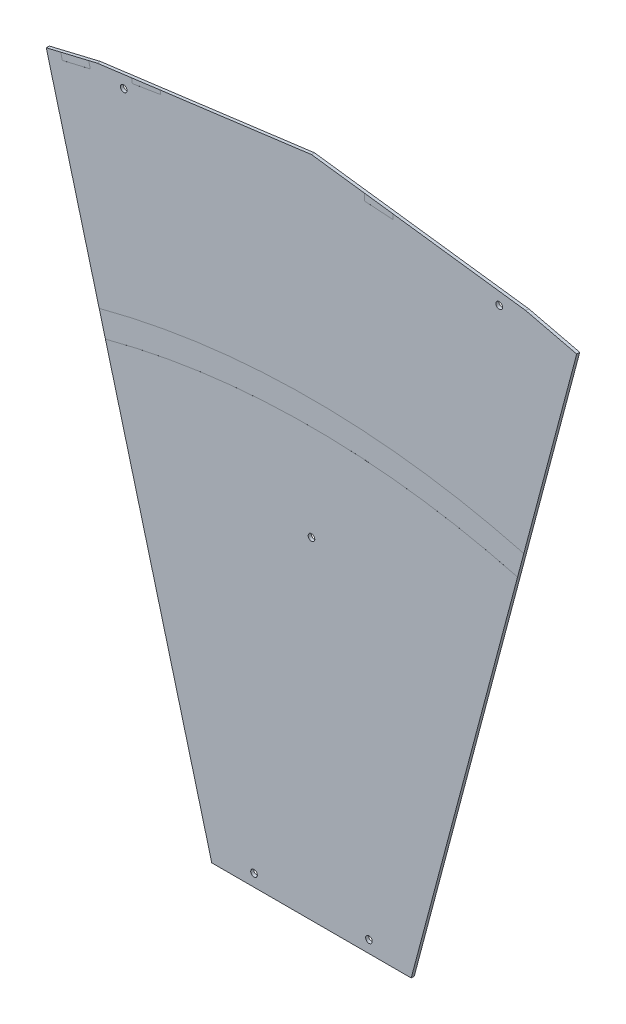
ISO-10303-21;
HEADER;
FILE_DESCRIPTION(('STEP AP214'),'2;1');
FILE_NAME('part.step','',(''),(''),'','','');
FILE_SCHEMA(('AUTOMOTIVE_DESIGN { 1 0 10303 214 1 1 1 1 }'));
ENDSEC;
DATA;
#1=APPLICATION_CONTEXT('core data for automotive mechanical design processes');
#2=APPLICATION_PROTOCOL_DEFINITION('international standard','automotive_design',2000,#1);
#3=PRODUCT_CONTEXT('',#1,'mechanical');
#4=PRODUCT('Part','Part','',(#3));
#5=PRODUCT_RELATED_PRODUCT_CATEGORY('part','',(#4));
#6=PRODUCT_DEFINITION_FORMATION('','',#4);
#7=PRODUCT_DEFINITION_CONTEXT('part definition',#1,'design');
#8=PRODUCT_DEFINITION('design','',#6,#7);
#9=PRODUCT_DEFINITION_SHAPE('','',#8);
#10=(LENGTH_UNIT() NAMED_UNIT(*) SI_UNIT(.MILLI.,.METRE.));
#11=(NAMED_UNIT(*) PLANE_ANGLE_UNIT() SI_UNIT($,.RADIAN.));
#12=(NAMED_UNIT(*) SI_UNIT($,.STERADIAN.) SOLID_ANGLE_UNIT());
#13=UNCERTAINTY_MEASURE_WITH_UNIT(LENGTH_MEASURE(1.E-05),#10,'distance_accuracy_value','');
#14=(GEOMETRIC_REPRESENTATION_CONTEXT(3) GLOBAL_UNCERTAINTY_ASSIGNED_CONTEXT((#13)) GLOBAL_UNIT_ASSIGNED_CONTEXT((#10,
#11,#12)) REPRESENTATION_CONTEXT('',''));
#15=CARTESIAN_POINT('',(0.,0.,0.));
#16=DIRECTION('',(0.,0.,1.));
#17=DIRECTION('',(1.,0.,0.));
#18=AXIS2_PLACEMENT_3D('',#15,#16,#17);
#19=CARTESIAN_POINT('',(-52.0600023755688,196.,1.58749999999985));
#20=DIRECTION('',(0.,0.,-1.));
#21=DIRECTION('',(0.,1.,0.));
#22=AXIS2_PLACEMENT_3D('',#19,#20,#21);
#23=PLANE('',#22);
#24=CARTESIAN_POINT('',(-30.,202.35,1.58749999999989));
#25=DIRECTION('',(0.,0.,1.));
#26=DIRECTION('',(1.,0.,0.));
#27=AXIS2_PLACEMENT_3D('',#24,#25,#26);
#28=CIRCLE('',#27,1.7272);
#29=CARTESIAN_POINT('',(-28.2728,202.35,1.58749999999989));
#30=VERTEX_POINT('',#29);
#31=EDGE_CURVE('E304',#30,#30,#28,.T.);
#32=ORIENTED_EDGE('',*,*,#31,.F.);
#33=EDGE_LOOP('',(#32));
#34=FACE_BOUND('',#33,.T.);
#35=CARTESIAN_POINT('',(0.,369.15,1.58749999999989));
#36=DIRECTION('',(0.,0.,1.));
#37=DIRECTION('',(1.,0.,0.));
#38=AXIS2_PLACEMENT_3D('',#35,#36,#37);
#39=CIRCLE('',#38,1.72720000000004);
#40=CARTESIAN_POINT('',(1.72720000000004,369.15,1.58749999999989));
#41=VERTEX_POINT('',#40);
#42=EDGE_CURVE('E298',#41,#41,#39,.T.);
#43=ORIENTED_EDGE('',*,*,#42,.F.);
#44=EDGE_LOOP('',(#43));
#45=FACE_BOUND('',#44,.T.);
#46=CARTESIAN_POINT('',(30.,202.35,1.58749999999989));
#47=DIRECTION('',(0.,0.,1.));
#48=DIRECTION('',(-1.,0.,0.));
#49=AXIS2_PLACEMENT_3D('',#46,#47,#48);
#50=CIRCLE('',#49,1.7272);
#51=CARTESIAN_POINT('',(28.2728,202.35,1.58749999999989));
#52=VERTEX_POINT('',#51);
#53=EDGE_CURVE('E292',#52,#52,#50,.T.);
#54=ORIENTED_EDGE('',*,*,#53,.F.);
#55=EDGE_LOOP('',(#54));
#56=FACE_BOUND('',#55,.T.);
#57=DIRECTION('',(-0.256711107580929,-0.966488182671973,0.));
#58=VECTOR('',#57,1.);
#59=CARTESIAN_POINT('',(139.214433641138,524.126541463011,1.58749999999978));
#60=LINE('',#59,#58);
#61=CARTESIAN_POINT('',(107.587625187167,405.055197357824,1.58749999999989));
#62=VERTEX_POINT('',#61);
#63=CARTESIAN_POINT('',(52.0600023755688,196.,1.58749999999985));
#64=VERTEX_POINT('',#63);
#65=EDGE_CURVE('E357',#62,#64,#60,.T.);
#66=ORIENTED_EDGE('',*,*,#65,.F.);
#67=CARTESIAN_POINT('',(0.,0.,1.58749999999989));
#68=DIRECTION('',(0.,0.,-1.));
#69=DIRECTION('',(-1.,0.,0.));
#70=AXIS2_PLACEMENT_3D('',#67,#68,#69);
#71=CIRCLE('',#70,419.1);
#72=CARTESIAN_POINT('',(-107.587625187167,405.055197357824,1.58749999999989));
#73=VERTEX_POINT('',#72);
#74=EDGE_CURVE('E257',#73,#62,#71,.T.);
#75=ORIENTED_EDGE('',*,*,#74,.F.);
#76=DIRECTION('',(-0.256711107580929,0.966488182671973,0.));
#77=VECTOR('',#76,1.);
#78=CARTESIAN_POINT('',(-52.0600023755688,196.,1.58749999999985));
#79=LINE('',#78,#77);
#80=CARTESIAN_POINT('',(-52.0600023755688,196.,1.58749999999985));
#81=VERTEX_POINT('',#80);
#82=EDGE_CURVE('E348',#81,#73,#79,.T.);
#83=ORIENTED_EDGE('',*,*,#82,.F.);
#84=DIRECTION('',(-1.,0.,0.));
#85=VECTOR('',#84,1.);
#86=CARTESIAN_POINT('',(52.0600023755688,196.,1.58749999999985));
#87=LINE('',#86,#85);
#88=EDGE_CURVE('E343',#64,#81,#87,.T.);
#89=ORIENTED_EDGE('',*,*,#88,.F.);
#90=EDGE_LOOP('',(#66,#75,#83,#89));
#91=FACE_BOUND('',#90,.T.);
#92=ADVANCED_FACE('F30',(#34,#45,#56,#91),#23,.F.);
#93=CARTESIAN_POINT('',(52.0600023755688,196.,1.58749999999985));
#94=DIRECTION('',(0.,-1.,0.));
#95=DIRECTION('',(0.,0.,-1.));
#96=AXIS2_PLACEMENT_3D('',#93,#94,#95);
#97=PLANE('',#96);
#98=DIRECTION('',(-1.,0.,0.));
#99=VECTOR('',#98,1.);
#100=CARTESIAN_POINT('',(52.0600023755688,196.,0.));
#101=LINE('',#100,#99);
#102=CARTESIAN_POINT('',(52.0600023755688,196.,0.));
#103=VERTEX_POINT('',#102);
#104=CARTESIAN_POINT('',(-52.0600023755688,196.,0.));
#105=VERTEX_POINT('',#104);
#106=EDGE_CURVE('E340',#103,#105,#101,.T.);
#107=ORIENTED_EDGE('',*,*,#106,.F.);
#108=DIRECTION('',(0.,0.,-1.));
#109=VECTOR('',#108,1.);
#110=CARTESIAN_POINT('',(52.0600023755688,196.,1.58749999999985));
#111=LINE('',#110,#109);
#112=EDGE_CURVE('E373',#64,#103,#111,.T.);
#113=ORIENTED_EDGE('',*,*,#112,.F.);
#114=ORIENTED_EDGE('',*,*,#88,.T.);
#115=DIRECTION('',(0.,0.,-1.));
#116=VECTOR('',#115,1.);
#117=CARTESIAN_POINT('',(-52.0600023755688,196.,1.58749999999985));
#118=LINE('',#117,#116);
#119=EDGE_CURVE('E361',#81,#105,#118,.T.);
#120=ORIENTED_EDGE('',*,*,#119,.T.);
#121=EDGE_LOOP('',(#107,#113,#114,#120));
#122=FACE_BOUND('',#121,.T.);
#123=ADVANCED_FACE('F32',(#122),#97,.T.);
#124=CARTESIAN_POINT('',(139.214433641138,524.126541463011,1.58749999999978));
#125=DIRECTION('',(0.966488182671973,-0.256711107580929,0.));
#126=DIRECTION('',(0.256711107580929,0.966488182671973,0.));
#127=AXIS2_PLACEMENT_3D('',#124,#125,#126);
#128=PLANE('',#127);
#129=DIRECTION('',(0.,0.,1.));
#130=VECTOR('',#129,1.);
#131=CARTESIAN_POINT('',(107.587625187167,405.055197357824,1.58249999999989));
#132=LINE('',#131,#130);
#133=CARTESIAN_POINT('',(107.587625187167,405.055197357824,1.58249999999989));
#134=VERTEX_POINT('',#133);
#135=EDGE_CURVE('E276',#134,#62,#132,.T.);
#136=ORIENTED_EDGE('',*,*,#135,.T.);
#137=ORIENTED_EDGE('',*,*,#65,.T.);
#138=ORIENTED_EDGE('',*,*,#112,.T.);
#139=DIRECTION('',(-0.256711107580929,-0.966488182671973,0.));
#140=VECTOR('',#139,1.);
#141=CARTESIAN_POINT('',(139.214433641138,524.126541463011,-1.15413476644949E-13));
#142=LINE('',#141,#140);
#143=CARTESIAN_POINT('',(138.475953663492,521.346248166548,-1.14801251752575E-13));
#144=VERTEX_POINT('',#143);
#145=EDGE_CURVE('E347',#144,#103,#142,.T.);
#146=ORIENTED_EDGE('',*,*,#145,.F.);
#147=DIRECTION('',(0.,0.,1.));
#148=VECTOR('',#147,1.);
#149=CARTESIAN_POINT('',(138.475953663492,521.346248166548,-1.20346441145891E-13));
#150=LINE('',#149,#148);
#151=CARTESIAN_POINT('',(138.475953663492,521.346248166548,1.58749999999989));
#152=VERTEX_POINT('',#151);
#153=EDGE_CURVE('E324',#144,#152,#150,.T.);
#154=ORIENTED_EDGE('',*,*,#153,.T.);
#155=CARTESIAN_POINT('',(110.847856253445,417.329597277758,1.5874999999998));
#156=VERTEX_POINT('',#155);
#157=EDGE_CURVE('E358',#152,#156,#60,.T.);
#158=ORIENTED_EDGE('',*,*,#157,.T.);
#159=DIRECTION('',(0.,0.,1.));
#160=VECTOR('',#159,1.);
#161=CARTESIAN_POINT('',(110.847856253445,417.329597277758,1.58249999999989));
#162=LINE('',#161,#160);
#163=CARTESIAN_POINT('',(110.847856253445,417.329597277758,1.58249999999989));
#164=VERTEX_POINT('',#163);
#165=EDGE_CURVE('E285',#164,#156,#162,.T.);
#166=ORIENTED_EDGE('',*,*,#165,.F.);
#167=DIRECTION('',(0.256711107580928,0.966488182671973,0.));
#168=VECTOR('',#167,1.);
#169=CARTESIAN_POINT('',(110.847856253445,417.329597277758,1.58249999999989));
#170=LINE('',#169,#168);
#171=EDGE_CURVE('E266',#134,#164,#170,.T.);
#172=ORIENTED_EDGE('',*,*,#171,.F.);
#173=EDGE_LOOP('',(#136,#137,#138,#146,#154,#158,#166,#172));
#174=FACE_BOUND('',#173,.T.);
#175=ADVANCED_FACE('F428',(#174),#128,.T.);
#176=CARTESIAN_POINT('',(0.,542.3,1.58749999999977));
#177=DIRECTION('',(0.129444616203277,0.99158665346806,0.));
#178=DIRECTION('',(-0.99158665346806,0.129444616203277,0.));
#179=AXIS2_PLACEMENT_3D('',#176,#177,#178);
#180=PLANE('',#179);
#181=DIRECTION('',(0.,0.,1.));
#182=VECTOR('',#181,1.);
#183=CARTESIAN_POINT('',(42.6950039305214,536.726469559413,1.58249999999989));
#184=LINE('',#183,#182);
#185=CARTESIAN_POINT('',(42.6950039305214,536.726469559413,1.58249999999989));
#186=VERTEX_POINT('',#185);
#187=CARTESIAN_POINT('',(42.6950039305214,536.726469559413,1.58749999999989));
#188=VERTEX_POINT('',#187);
#189=EDGE_CURVE('E225',#186,#188,#184,.T.);
#190=ORIENTED_EDGE('',*,*,#189,.T.);
#191=DIRECTION('',(0.99158665346806,-0.129444616203277,0.));
#192=VECTOR('',#191,1.);
#193=CARTESIAN_POINT('',(0.,542.3,1.58749999999977));
#194=LINE('',#193,#192);
#195=CARTESIAN_POINT('',(111.862580020806,527.697132275169,1.58749999999989));
#196=VERTEX_POINT('',#195);
#197=EDGE_CURVE('E355',#188,#196,#194,.T.);
#198=ORIENTED_EDGE('',*,*,#197,.T.);
#199=DIRECTION('',(0.,0.,1.));
#200=VECTOR('',#199,1.);
#201=CARTESIAN_POINT('',(111.862580020806,527.697132275169,-1.20346441145891E-13));
#202=LINE('',#201,#200);
#203=CARTESIAN_POINT('',(111.862580020806,527.697132275169,-1.20346441145891E-13));
#204=VERTEX_POINT('',#203);
#205=EDGE_CURVE('E322',#204,#196,#202,.T.);
#206=ORIENTED_EDGE('',*,*,#205,.F.);
#207=DIRECTION('',(0.99158665346806,-0.129444616203277,0.));
#208=VECTOR('',#207,1.);
#209=CARTESIAN_POINT('',(0.,542.3,-1.20414789250844E-13));
#210=LINE('',#209,#208);
#211=CARTESIAN_POINT('',(0.,542.3,-1.20414789250844E-13));
#212=VERTEX_POINT('',#211);
#213=EDGE_CURVE('E369',#212,#204,#210,.T.);
#214=ORIENTED_EDGE('',*,*,#213,.F.);
#215=DIRECTION('',(0.,0.,-1.));
#216=VECTOR('',#215,1.);
#217=CARTESIAN_POINT('',(0.,542.3,1.58749999999977));
#218=LINE('',#217,#216);
#219=CARTESIAN_POINT('',(0.,542.3,1.58749999999977));
#220=VERTEX_POINT('',#219);
#221=EDGE_CURVE('E377',#220,#212,#218,.T.);
#222=ORIENTED_EDGE('',*,*,#221,.F.);
#223=CARTESIAN_POINT('',(27.790346618401,538.672167031905,1.58749999999977));
#224=VERTEX_POINT('',#223);
#225=EDGE_CURVE('E208',#220,#224,#194,.T.);
#226=ORIENTED_EDGE('',*,*,#225,.T.);
#227=DIRECTION('',(0.,0.,1.));
#228=VECTOR('',#227,1.);
#229=CARTESIAN_POINT('',(27.790346618401,538.672167031905,1.58249999999989));
#230=LINE('',#229,#228);
#231=CARTESIAN_POINT('',(27.790346618401,538.672167031905,1.58249999999989));
#232=VERTEX_POINT('',#231);
#233=EDGE_CURVE('E45',#232,#224,#230,.T.);
#234=ORIENTED_EDGE('',*,*,#233,.F.);
#235=DIRECTION('',(-0.99158665346806,0.129444616203278,0.));
#236=VECTOR('',#235,1.);
#237=CARTESIAN_POINT('',(42.6950039305214,536.726469559413,1.58249999999989));
#238=LINE('',#237,#236);
#239=EDGE_CURVE('E193',#186,#232,#238,.T.);
#240=ORIENTED_EDGE('',*,*,#239,.F.);
#241=EDGE_LOOP('',(#190,#198,#206,#214,#222,#226,#234,#240));
#242=FACE_BOUND('',#241,.T.);
#243=ADVANCED_FACE('F205',(#242),#180,.T.);
#244=CARTESIAN_POINT('',(-139.214433641138,524.126541463011,1.58749999999978));
#245=DIRECTION('',(-0.129444616203277,0.99158665346806,0.));
#246=DIRECTION('',(-0.99158665346806,-0.129444616203277,0.));
#247=AXIS2_PLACEMENT_3D('',#244,#245,#246);
#248=PLANE('',#247);
#249=DIRECTION('',(0.,0.,1.));
#250=VECTOR('',#249,1.);
#251=CARTESIAN_POINT('',(-79.0399411374419,531.981895364886,1.58249999999989));
#252=LINE('',#251,#250);
#253=CARTESIAN_POINT('',(-79.0399411374419,531.981895364886,1.58249999999989));
#254=VERTEX_POINT('',#253);
#255=CARTESIAN_POINT('',(-79.0399411374419,531.981895364886,1.58749999999989));
#256=VERTEX_POINT('',#255);
#257=EDGE_CURVE('E254',#254,#256,#252,.T.);
#258=ORIENTED_EDGE('',*,*,#257,.T.);
#259=DIRECTION('',(0.99158665346806,0.129444616203277,0.));
#260=VECTOR('',#259,1.);
#261=CARTESIAN_POINT('',(-139.214433641138,524.126541463011,1.58749999999978));
#262=LINE('',#261,#260);
#263=EDGE_CURVE('E351',#256,#220,#262,.T.);
#264=ORIENTED_EDGE('',*,*,#263,.T.);
#265=ORIENTED_EDGE('',*,*,#221,.T.);
#266=DIRECTION('',(0.99158665346806,0.129444616203277,0.));
#267=VECTOR('',#266,1.);
#268=CARTESIAN_POINT('',(-139.214433641138,524.126541463011,-1.17345465014806E-13));
#269=LINE('',#268,#267);
#270=CARTESIAN_POINT('',(-111.862580020806,527.697132275169,-1.17948503830694E-13));
#271=VERTEX_POINT('',#270);
#272=EDGE_CURVE('E367',#271,#212,#269,.T.);
#273=ORIENTED_EDGE('',*,*,#272,.F.);
#274=DIRECTION('',(0.,0.,1.));
#275=VECTOR('',#274,1.);
#276=CARTESIAN_POINT('',(-111.862580020806,527.697132275169,-1.20346441145891E-13));
#277=LINE('',#276,#275);
#278=CARTESIAN_POINT('',(-111.862580020806,527.697132275169,1.58749999999989));
#279=VERTEX_POINT('',#278);
#280=EDGE_CURVE('E337',#271,#279,#277,.T.);
#281=ORIENTED_EDGE('',*,*,#280,.T.);
#282=CARTESIAN_POINT('',(-93.9211862672078,530.03925418702,1.58749999999978));
#283=VERTEX_POINT('',#282);
#284=EDGE_CURVE('E352',#279,#283,#262,.T.);
#285=ORIENTED_EDGE('',*,*,#284,.T.);
#286=DIRECTION('',(0.,0.,1.));
#287=VECTOR('',#286,1.);
#288=CARTESIAN_POINT('',(-93.9211862672078,530.03925418702,1.58249999999989));
#289=LINE('',#288,#287);
#290=CARTESIAN_POINT('',(-93.9211862672078,530.03925418702,1.58249999999989));
#291=VERTEX_POINT('',#290);
#292=EDGE_CURVE('E247',#291,#283,#289,.T.);
#293=ORIENTED_EDGE('',*,*,#292,.F.);
#294=DIRECTION('',(-0.99158665346806,-0.129444616203276,0.));
#295=VECTOR('',#294,1.);
#296=CARTESIAN_POINT('',(-79.0399411374419,531.981895364886,1.58249999999989));
#297=LINE('',#296,#295);
#298=EDGE_CURVE('E234',#254,#291,#297,.T.);
#299=ORIENTED_EDGE('',*,*,#298,.F.);
#300=EDGE_LOOP('',(#258,#264,#265,#273,#281,#285,#293,#299));
#301=FACE_BOUND('',#300,.T.);
#302=ADVANCED_FACE('F409',(#301),#248,.T.);
#303=CARTESIAN_POINT('',(-52.0600023755688,196.,1.58749999999985));
#304=DIRECTION('',(-0.966488182671973,-0.256711107580929,0.));
#305=DIRECTION('',(0.256711107580929,-0.966488182671973,0.));
#306=AXIS2_PLACEMENT_3D('',#303,#304,#305);
#307=PLANE('',#306);
#308=DIRECTION('',(0.,0.,1.));
#309=VECTOR('',#308,1.);
#310=CARTESIAN_POINT('',(-107.587625187167,405.055197357824,1.58249999999989));
#311=LINE('',#310,#309);
#312=CARTESIAN_POINT('',(-107.587625187167,405.055197357824,1.58249999999989));
#313=VERTEX_POINT('',#312);
#314=EDGE_CURVE('E279',#313,#73,#311,.T.);
#315=ORIENTED_EDGE('',*,*,#314,.F.);
#316=DIRECTION('',(0.256711107580929,-0.966488182671973,0.));
#317=VECTOR('',#316,1.);
#318=CARTESIAN_POINT('',(-107.587625187167,405.055197357824,1.58249999999989));
#319=LINE('',#318,#317);
#320=CARTESIAN_POINT('',(-110.847856253445,417.329597277758,1.58249999999989));
#321=VERTEX_POINT('',#320);
#322=EDGE_CURVE('E273',#321,#313,#319,.T.);
#323=ORIENTED_EDGE('',*,*,#322,.F.);
#324=DIRECTION('',(0.,0.,1.));
#325=VECTOR('',#324,1.);
#326=CARTESIAN_POINT('',(-110.847856253445,417.329597277758,1.58249999999989));
#327=LINE('',#326,#325);
#328=CARTESIAN_POINT('',(-110.847856253445,417.329597277758,1.58749999999989));
#329=VERTEX_POINT('',#328);
#330=EDGE_CURVE('E282',#321,#329,#327,.T.);
#331=ORIENTED_EDGE('',*,*,#330,.T.);
#332=CARTESIAN_POINT('',(-138.475953663492,521.346248166548,1.58749999999989));
#333=VERTEX_POINT('',#332);
#334=EDGE_CURVE('E346',#329,#333,#79,.T.);
#335=ORIENTED_EDGE('',*,*,#334,.T.);
#336=DIRECTION('',(0.,0.,1.));
#337=VECTOR('',#336,1.);
#338=CARTESIAN_POINT('',(-138.475953663492,521.346248166548,-1.20346441145891E-13));
#339=LINE('',#338,#337);
#340=CARTESIAN_POINT('',(-138.475953663492,521.346248166548,-1.20346441145891E-13));
#341=VERTEX_POINT('',#340);
#342=EDGE_CURVE('E333',#341,#333,#339,.T.);
#343=ORIENTED_EDGE('',*,*,#342,.F.);
#344=DIRECTION('',(-0.256711107580929,0.966488182671973,0.));
#345=VECTOR('',#344,1.);
#346=CARTESIAN_POINT('',(-52.0600023755688,196.,0.));
#347=LINE('',#346,#345);
#348=EDGE_CURVE('E364',#105,#341,#347,.T.);
#349=ORIENTED_EDGE('',*,*,#348,.F.);
#350=ORIENTED_EDGE('',*,*,#119,.F.);
#351=ORIENTED_EDGE('',*,*,#82,.T.);
#352=EDGE_LOOP('',(#315,#323,#331,#335,#343,#349,#350,#351));
#353=FACE_BOUND('',#352,.T.);
#354=ADVANCED_FACE('F419',(#353),#307,.T.);
#355=CARTESIAN_POINT('',(98.0409242651112,523.097573518041,1.58749999999989));
#356=DIRECTION('',(0.,0.,1.));
#357=DIRECTION('',(-1.,0.,0.));
#358=AXIS2_PLACEMENT_3D('',#355,#356,#357);
#359=CIRCLE('',#358,1.72720000000006);
#360=CARTESIAN_POINT('',(96.3137242651112,523.097573518041,1.58749999999989));
#361=VERTEX_POINT('',#360);
#362=EDGE_CURVE('E281',#361,#361,#359,.T.);
#363=ORIENTED_EDGE('',*,*,#362,.F.);
#364=EDGE_LOOP('',(#363));
#365=FACE_BOUND('',#364,.T.);
#366=CARTESIAN_POINT('',(-98.0409242651112,523.097573518041,1.58749999999989));
#367=DIRECTION('',(0.,0.,1.));
#368=DIRECTION('',(1.,0.,0.));
#369=AXIS2_PLACEMENT_3D('',#366,#367,#368);
#370=CIRCLE('',#369,1.72720000000006);
#371=CARTESIAN_POINT('',(-96.3137242651112,523.097573518041,1.58749999999989));
#372=VERTEX_POINT('',#371);
#373=EDGE_CURVE('E310',#372,#372,#370,.T.);
#374=ORIENTED_EDGE('',*,*,#373,.F.);
#375=EDGE_LOOP('',(#374));
#376=FACE_BOUND('',#375,.T.);
#377=ORIENTED_EDGE('',*,*,#197,.F.);
#378=DIRECTION('',(0.0654031292300864,0.997858923238607,0.));
#379=VECTOR('',#378,1.);
#380=CARTESIAN_POINT('',(42.5269385657457,534.162287602022,1.58749999999989));
#381=LINE('',#380,#379);
#382=CARTESIAN_POINT('',(42.5269385657457,534.162287602022,1.58749999999989));
#383=VERTEX_POINT('',#382);
#384=EDGE_CURVE('E202',#383,#188,#381,.T.);
#385=ORIENTED_EDGE('',*,*,#384,.F.);
#386=DIRECTION('',(0.997858923238607,-0.0654031292300916,0.));
#387=VECTOR('',#386,1.);
#388=CARTESIAN_POINT('',(27.5590547172177,535.14333454047,1.58749999999989));
#389=LINE('',#388,#387);
#390=CARTESIAN_POINT('',(27.5590547172177,535.14333454047,1.58749999999989));
#391=VERTEX_POINT('',#390);
#392=EDGE_CURVE('E438',#391,#383,#389,.T.);
#393=ORIENTED_EDGE('',*,*,#392,.F.);
#394=DIRECTION('',(-0.0654031292300884,-0.997858923238607,0.));
#395=VECTOR('',#394,1.);
#396=CARTESIAN_POINT('',(27.790346618401,538.672167031905,1.58749999999989));
#397=LINE('',#396,#395);
#398=EDGE_CURVE('E441',#224,#391,#397,.T.);
#399=ORIENTED_EDGE('',*,*,#398,.F.);
#400=ORIENTED_EDGE('',*,*,#225,.F.);
#401=ORIENTED_EDGE('',*,*,#263,.F.);
#402=DIRECTION('',(-0.160742565603862,0.986996366560226,0.));
#403=VECTOR('',#402,1.);
#404=CARTESIAN_POINT('',(-78.7233939013794,530.038222444993,1.58749999999989));
#405=LINE('',#404,#403);
#406=CARTESIAN_POINT('',(-78.7233939013794,530.038222444993,1.58749999999989));
#407=VERTEX_POINT('',#406);
#408=EDGE_CURVE('E238',#407,#256,#405,.T.);
#409=ORIENTED_EDGE('',*,*,#408,.F.);
#410=DIRECTION('',(0.986996366560225,0.160742565603871,0.));
#411=VECTOR('',#410,1.);
#412=CARTESIAN_POINT('',(-93.5283393997322,527.627083960943,1.58749999999989));
#413=LINE('',#412,#411);
#414=CARTESIAN_POINT('',(-93.5283393997322,527.627083960943,1.58749999999989));
#415=VERTEX_POINT('',#414);
#416=EDGE_CURVE('E250',#415,#407,#413,.T.);
#417=ORIENTED_EDGE('',*,*,#416,.F.);
#418=DIRECTION('',(0.160742565603883,-0.986996366560223,0.));
#419=VECTOR('',#418,1.);
#420=CARTESIAN_POINT('',(-93.9211862672078,530.03925418702,1.58749999999989));
#421=LINE('',#420,#419);
#422=EDGE_CURVE('E231',#283,#415,#421,.T.);
#423=ORIENTED_EDGE('',*,*,#422,.F.);
#424=ORIENTED_EDGE('',*,*,#284,.F.);
#425=DIRECTION('',(0.972687775406542,0.232117409029725,0.));
#426=VECTOR('',#425,1.);
#427=CARTESIAN_POINT('',(-138.475953663492,521.346248166548,1.58749999999989));
#428=LINE('',#427,#426);
#429=CARTESIAN_POINT('',(-116.301629699761,526.637819373244,1.58749999999989));
#430=VERTEX_POINT('',#429);
#431=EDGE_CURVE('E327',#430,#279,#428,.T.);
#432=ORIENTED_EDGE('',*,*,#431,.F.);
#433=DIRECTION('',(-0.229200390922413,0.973379258460449,0.));
#434=VECTOR('',#433,1.);
#435=CARTESIAN_POINT('',(-115.505225017795,523.255609615022,1.58749999999989));
#436=LINE('',#435,#434);
#437=CARTESIAN_POINT('',(-115.505225017795,523.255609615022,1.58749999999989));
#438=VERTEX_POINT('',#437);
#439=EDGE_CURVE('E218',#438,#430,#436,.T.);
#440=ORIENTED_EDGE('',*,*,#439,.F.);
#441=DIRECTION('',(0.97337925846045,0.229200390922405,0.));
#442=VECTOR('',#441,1.);
#443=CARTESIAN_POINT('',(-130.105913894652,519.817603751197,1.58749999999989));
#444=LINE('',#443,#442);
#445=CARTESIAN_POINT('',(-130.105913894652,519.817603751197,1.58749999999989));
#446=VERTEX_POINT('',#445);
#447=EDGE_CURVE('E224',#446,#438,#444,.T.);
#448=ORIENTED_EDGE('',*,*,#447,.F.);
#449=DIRECTION('',(0.229200390922405,-0.973379258460451,0.));
#450=VECTOR('',#449,1.);
#451=CARTESIAN_POINT('',(-131.361910987031,525.151632691935,1.58749999999989));
#452=LINE('',#451,#450);
#453=CARTESIAN_POINT('',(-130.892011893738,523.156042592196,1.58749999999989));
#454=VERTEX_POINT('',#453);
#455=EDGE_CURVE('E222',#454,#446,#452,.T.);
#456=ORIENTED_EDGE('',*,*,#455,.F.);
#457=EDGE_CURVE('E334',#333,#454,#428,.T.);
#458=ORIENTED_EDGE('',*,*,#457,.F.);
#459=ORIENTED_EDGE('',*,*,#334,.F.);
#460=CARTESIAN_POINT('',(0.,0.,1.58749999999989));
#461=DIRECTION('',(0.,0.,1.));
#462=DIRECTION('',(1.,0.,0.));
#463=AXIS2_PLACEMENT_3D('',#460,#461,#462);
#464=CIRCLE('',#463,431.8);
#465=EDGE_CURVE('E267',#156,#329,#464,.T.);
#466=ORIENTED_EDGE('',*,*,#465,.F.);
#467=ORIENTED_EDGE('',*,*,#157,.F.);
#468=DIRECTION('',(0.972687775406542,-0.232117409029725,0.));
#469=VECTOR('',#468,1.);
#470=CARTESIAN_POINT('',(138.475953663492,521.346248166548,1.58749999999989));
#471=LINE('',#470,#469);
#472=EDGE_CURVE('E316',#196,#152,#471,.T.);
#473=ORIENTED_EDGE('',*,*,#472,.F.);
#474=EDGE_LOOP('',(#377,#385,#393,#399,#400,#401,#409,#417,#423,#424,#432,#440,#448,#456,#458,
#459,#466,#467,#473));
#475=FACE_BOUND('',#474,.T.);
#476=ADVANCED_FACE('F394',(#365,#376,#475),#23,.F.);
#477=CARTESIAN_POINT('',(-52.0600023755688,196.,0.));
#478=DIRECTION('',(0.,0.,-1.));
#479=DIRECTION('',(0.,1.,0.));
#480=AXIS2_PLACEMENT_3D('',#477,#478,#479);
#481=PLANE('',#480);
#482=CARTESIAN_POINT('',(98.0409242651112,523.097573518041,-1.20346441145891E-13));
#483=DIRECTION('',(0.,0.,1.));
#484=DIRECTION('',(-1.,0.,0.));
#485=AXIS2_PLACEMENT_3D('',#482,#483,#484);
#486=CIRCLE('',#485,1.72720000000006);
#487=CARTESIAN_POINT('',(96.3137242651112,523.097573518041,-1.20346441145891E-13));
#488=VERTEX_POINT('',#487);
#489=EDGE_CURVE('E289',#488,#488,#486,.T.);
#490=ORIENTED_EDGE('',*,*,#489,.T.);
#491=EDGE_LOOP('',(#490));
#492=FACE_BOUND('',#491,.T.);
#493=CARTESIAN_POINT('',(30.,202.35,-1.20346441145891E-13));
#494=DIRECTION('',(0.,0.,1.));
#495=DIRECTION('',(-1.,0.,0.));
#496=AXIS2_PLACEMENT_3D('',#493,#494,#495);
#497=CIRCLE('',#496,1.7272);
#498=CARTESIAN_POINT('',(28.2728,202.35,-1.20346441145891E-13));
#499=VERTEX_POINT('',#498);
#500=EDGE_CURVE('E295',#499,#499,#497,.T.);
#501=ORIENTED_EDGE('',*,*,#500,.T.);
#502=EDGE_LOOP('',(#501));
#503=FACE_BOUND('',#502,.T.);
#504=CARTESIAN_POINT('',(0.,369.15,-1.20346441145891E-13));
#505=DIRECTION('',(0.,0.,1.));
#506=DIRECTION('',(1.,0.,0.));
#507=AXIS2_PLACEMENT_3D('',#504,#505,#506);
#508=CIRCLE('',#507,1.72720000000004);
#509=CARTESIAN_POINT('',(1.72720000000004,369.15,-1.20346441145891E-13));
#510=VERTEX_POINT('',#509);
#511=EDGE_CURVE('E301',#510,#510,#508,.T.);
#512=ORIENTED_EDGE('',*,*,#511,.T.);
#513=EDGE_LOOP('',(#512));
#514=FACE_BOUND('',#513,.T.);
#515=CARTESIAN_POINT('',(-30.,202.35,-1.20346441145891E-13));
#516=DIRECTION('',(0.,0.,1.));
#517=DIRECTION('',(1.,0.,0.));
#518=AXIS2_PLACEMENT_3D('',#515,#516,#517);
#519=CIRCLE('',#518,1.7272);
#520=CARTESIAN_POINT('',(-28.2728,202.35,-1.20346441145891E-13));
#521=VERTEX_POINT('',#520);
#522=EDGE_CURVE('E307',#521,#521,#519,.T.);
#523=ORIENTED_EDGE('',*,*,#522,.T.);
#524=EDGE_LOOP('',(#523));
#525=FACE_BOUND('',#524,.T.);
#526=CARTESIAN_POINT('',(-98.0409242651112,523.097573518041,-1.20346441145891E-13));
#527=DIRECTION('',(0.,0.,1.));
#528=DIRECTION('',(1.,0.,0.));
#529=AXIS2_PLACEMENT_3D('',#526,#527,#528);
#530=CIRCLE('',#529,1.72720000000006);
#531=CARTESIAN_POINT('',(-96.3137242651112,523.097573518041,-1.20346441145891E-13));
#532=VERTEX_POINT('',#531);
#533=EDGE_CURVE('E313',#532,#532,#530,.T.);
#534=ORIENTED_EDGE('',*,*,#533,.T.);
#535=EDGE_LOOP('',(#534));
#536=FACE_BOUND('',#535,.T.);
#537=DIRECTION('',(0.972687775406542,-0.232117409029725,0.));
#538=VECTOR('',#537,1.);
#539=CARTESIAN_POINT('',(138.475953663492,521.346248166548,-1.20346441145891E-13));
#540=LINE('',#539,#538);
#541=EDGE_CURVE('E319',#204,#144,#540,.T.);
#542=ORIENTED_EDGE('',*,*,#541,.T.);
#543=ORIENTED_EDGE('',*,*,#145,.T.);
#544=ORIENTED_EDGE('',*,*,#106,.T.);
#545=ORIENTED_EDGE('',*,*,#348,.T.);
#546=DIRECTION('',(0.972687775406542,0.232117409029725,0.));
#547=VECTOR('',#546,1.);
#548=CARTESIAN_POINT('',(-138.475953663492,521.346248166548,-1.20346441145891E-13));
#549=LINE('',#548,#547);
#550=EDGE_CURVE('E330',#341,#271,#549,.T.);
#551=ORIENTED_EDGE('',*,*,#550,.T.);
#552=ORIENTED_EDGE('',*,*,#272,.T.);
#553=ORIENTED_EDGE('',*,*,#213,.T.);
#554=EDGE_LOOP('',(#542,#543,#544,#545,#551,#552,#553));
#555=FACE_BOUND('',#554,.T.);
#556=ADVANCED_FACE('F414',(#492,#503,#514,#525,#536,#555),#481,.T.);
#557=CARTESIAN_POINT('',(-138.475953663492,521.346248166548,-1.20346441145891E-13));
#558=DIRECTION('',(0.232117409029725,-0.972687775406542,0.));
#559=DIRECTION('',(0.972687775406542,0.232117409029725,0.));
#560=AXIS2_PLACEMENT_3D('',#557,#558,#559);
#561=PLANE('',#560);
#562=DIRECTION('',(-0.972687775406542,-0.232117409029725,0.));
#563=VECTOR('',#562,1.);
#564=CARTESIAN_POINT('',(-138.475953663492,521.346248166548,1.58249999999989));
#565=LINE('',#564,#563);
#566=CARTESIAN_POINT('',(-116.301629699761,526.637819373244,1.58249999999989));
#567=VERTEX_POINT('',#566);
#568=CARTESIAN_POINT('',(-130.892011893738,523.156042592196,1.58249999999989));
#569=VERTEX_POINT('',#568);
#570=EDGE_CURVE('E376',#567,#569,#565,.T.);
#571=ORIENTED_EDGE('',*,*,#570,.F.);
#572=DIRECTION('',(0.,0.,1.));
#573=VECTOR('',#572,1.);
#574=CARTESIAN_POINT('',(-116.301629699761,526.637819373244,-1.20346441145891E-13));
#575=LINE('',#574,#573);
#576=EDGE_CURVE('E11',#567,#430,#575,.T.);
#577=ORIENTED_EDGE('',*,*,#576,.T.);
#578=ORIENTED_EDGE('',*,*,#431,.T.);
#579=ORIENTED_EDGE('',*,*,#280,.F.);
#580=ORIENTED_EDGE('',*,*,#550,.F.);
#581=ORIENTED_EDGE('',*,*,#342,.T.);
#582=ORIENTED_EDGE('',*,*,#457,.T.);
#583=DIRECTION('',(0.,0.,-1.));
#584=VECTOR('',#583,1.);
#585=CARTESIAN_POINT('',(-130.892011893738,523.156042592196,-1.20346441145891E-13));
#586=LINE('',#585,#584);
#587=EDGE_CURVE('E38',#454,#569,#586,.T.);
#588=ORIENTED_EDGE('',*,*,#587,.T.);
#589=EDGE_LOOP('',(#571,#577,#578,#579,#580,#581,#582,#588));
#590=FACE_BOUND('',#589,.T.);
#591=ADVANCED_FACE('F384',(#590),#561,.F.);
#592=CARTESIAN_POINT('',(138.475953663492,521.346248166548,-1.20346441145891E-13));
#593=DIRECTION('',(-0.232117409029725,-0.972687775406542,0.));
#594=DIRECTION('',(0.972687775406542,-0.232117409029725,0.));
#595=AXIS2_PLACEMENT_3D('',#592,#593,#594);
#596=PLANE('',#595);
#597=ORIENTED_EDGE('',*,*,#472,.T.);
#598=ORIENTED_EDGE('',*,*,#153,.F.);
#599=ORIENTED_EDGE('',*,*,#541,.F.);
#600=ORIENTED_EDGE('',*,*,#205,.T.);
#601=EDGE_LOOP('',(#597,#598,#599,#600));
#602=FACE_BOUND('',#601,.T.);
#603=ADVANCED_FACE('F432',(#602),#596,.F.);
#604=CARTESIAN_POINT('',(-98.0409242651112,523.097573518041,-1.20346441145891E-13));
#605=DIRECTION('',(0.,0.,1.));
#606=DIRECTION('',(1.,0.,0.));
#607=AXIS2_PLACEMENT_3D('',#604,#605,#606);
#608=CYLINDRICAL_SURFACE('',#607,1.72720000000006);
#609=ORIENTED_EDGE('',*,*,#533,.F.);
#610=EDGE_LOOP('',(#609));
#611=FACE_BOUND('',#610,.T.);
#612=ORIENTED_EDGE('',*,*,#373,.T.);
#613=EDGE_LOOP('',(#612));
#614=FACE_BOUND('',#613,.T.);
#615=ADVANCED_FACE('F492',(#611,#614),#608,.F.);
#616=CARTESIAN_POINT('',(-30.,202.35,-1.20346441145891E-13));
#617=DIRECTION('',(0.,0.,1.));
#618=DIRECTION('',(1.,0.,0.));
#619=AXIS2_PLACEMENT_3D('',#616,#617,#618);
#620=CYLINDRICAL_SURFACE('',#619,1.7272);
#621=ORIENTED_EDGE('',*,*,#522,.F.);
#622=EDGE_LOOP('',(#621));
#623=FACE_BOUND('',#622,.T.);
#624=ORIENTED_EDGE('',*,*,#31,.T.);
#625=EDGE_LOOP('',(#624));
#626=FACE_BOUND('',#625,.T.);
#627=ADVANCED_FACE('F494',(#623,#626),#620,.F.);
#628=CARTESIAN_POINT('',(0.,369.15,-1.20346441145891E-13));
#629=DIRECTION('',(0.,0.,1.));
#630=DIRECTION('',(1.,0.,0.));
#631=AXIS2_PLACEMENT_3D('',#628,#629,#630);
#632=CYLINDRICAL_SURFACE('',#631,1.72720000000004);
#633=ORIENTED_EDGE('',*,*,#511,.F.);
#634=EDGE_LOOP('',(#633));
#635=FACE_BOUND('',#634,.T.);
#636=ORIENTED_EDGE('',*,*,#42,.T.);
#637=EDGE_LOOP('',(#636));
#638=FACE_BOUND('',#637,.T.);
#639=ADVANCED_FACE('F501',(#635,#638),#632,.F.);
#640=CARTESIAN_POINT('',(30.,202.35,-1.20346441145891E-13));
#641=DIRECTION('',(0.,0.,1.));
#642=DIRECTION('',(1.,0.,0.));
#643=AXIS2_PLACEMENT_3D('',#640,#641,#642);
#644=CYLINDRICAL_SURFACE('',#643,1.7272);
#645=ORIENTED_EDGE('',*,*,#500,.F.);
#646=EDGE_LOOP('',(#645));
#647=FACE_BOUND('',#646,.T.);
#648=ORIENTED_EDGE('',*,*,#53,.T.);
#649=EDGE_LOOP('',(#648));
#650=FACE_BOUND('',#649,.T.);
#651=ADVANCED_FACE('F544',(#647,#650),#644,.F.);
#652=CARTESIAN_POINT('',(98.0409242651112,523.097573518041,-1.20346441145891E-13));
#653=DIRECTION('',(0.,0.,1.));
#654=DIRECTION('',(1.,0.,0.));
#655=AXIS2_PLACEMENT_3D('',#652,#653,#654);
#656=CYLINDRICAL_SURFACE('',#655,1.72720000000006);
#657=ORIENTED_EDGE('',*,*,#489,.F.);
#658=EDGE_LOOP('',(#657));
#659=FACE_BOUND('',#658,.T.);
#660=ORIENTED_EDGE('',*,*,#362,.T.);
#661=EDGE_LOOP('',(#660));
#662=FACE_BOUND('',#661,.T.);
#663=ADVANCED_FACE('F553',(#659,#662),#656,.F.);
#664=CARTESIAN_POINT('',(0.,0.,1.58249999999989));
#665=DIRECTION('',(0.,0.,1.));
#666=DIRECTION('',(1.,0.,0.));
#667=AXIS2_PLACEMENT_3D('',#664,#665,#666);
#668=CYLINDRICAL_SURFACE('',#667,419.1);
#669=ORIENTED_EDGE('',*,*,#74,.T.);
#670=ORIENTED_EDGE('',*,*,#135,.F.);
#671=CARTESIAN_POINT('',(0.,0.,1.58249999999989));
#672=DIRECTION('',(0.,0.,-1.));
#673=DIRECTION('',(-1.,0.,0.));
#674=AXIS2_PLACEMENT_3D('',#671,#672,#673);
#675=CIRCLE('',#674,419.1);
#676=EDGE_CURVE('E263',#313,#134,#675,.T.);
#677=ORIENTED_EDGE('',*,*,#676,.F.);
#678=ORIENTED_EDGE('',*,*,#314,.T.);
#679=EDGE_LOOP('',(#669,#670,#677,#678));
#680=FACE_BOUND('',#679,.T.);
#681=ADVANCED_FACE('F562',(#680),#668,.T.);
#682=CARTESIAN_POINT('',(0.,0.,1.58249999999989));
#683=DIRECTION('',(0.,0.,1.));
#684=DIRECTION('',(1.,0.,0.));
#685=AXIS2_PLACEMENT_3D('',#682,#683,#684);
#686=CYLINDRICAL_SURFACE('',#685,431.8);
#687=ORIENTED_EDGE('',*,*,#465,.T.);
#688=ORIENTED_EDGE('',*,*,#330,.F.);
#689=CARTESIAN_POINT('',(0.,0.,1.58249999999989));
#690=DIRECTION('',(0.,0.,1.));
#691=DIRECTION('',(1.,0.,0.));
#692=AXIS2_PLACEMENT_3D('',#689,#690,#691);
#693=CIRCLE('',#692,431.8);
#694=EDGE_CURVE('E270',#164,#321,#693,.T.);
#695=ORIENTED_EDGE('',*,*,#694,.F.);
#696=ORIENTED_EDGE('',*,*,#165,.T.);
#697=EDGE_LOOP('',(#687,#688,#695,#696));
#698=FACE_BOUND('',#697,.T.);
#699=ADVANCED_FACE('F613',(#698),#686,.F.);
#700=CARTESIAN_POINT('',(0.,0.,1.58249999999989));
#701=DIRECTION('',(0.,0.,-1.));
#702=DIRECTION('',(-1.,0.,0.));
#703=AXIS2_PLACEMENT_3D('',#700,#701,#702);
#704=PLANE('',#703);
#705=ORIENTED_EDGE('',*,*,#676,.T.);
#706=ORIENTED_EDGE('',*,*,#171,.T.);
#707=ORIENTED_EDGE('',*,*,#694,.T.);
#708=ORIENTED_EDGE('',*,*,#322,.T.);
#709=EDGE_LOOP('',(#705,#706,#707,#708));
#710=FACE_BOUND('',#709,.T.);
#711=ADVANCED_FACE('F622',(#710),#704,.F.);
#712=CARTESIAN_POINT('',(-78.7233939013794,530.038222444993,1.58249999999989));
#713=DIRECTION('',(0.986996366560226,0.160742565603862,0.));
#714=DIRECTION('',(-0.160742565603862,0.986996366560226,0.));
#715=AXIS2_PLACEMENT_3D('',#712,#713,#714);
#716=PLANE('',#715);
#717=ORIENTED_EDGE('',*,*,#408,.T.);
#718=ORIENTED_EDGE('',*,*,#257,.F.);
#719=DIRECTION('',(-0.160742565603862,0.986996366560226,0.));
#720=VECTOR('',#719,1.);
#721=CARTESIAN_POINT('',(-78.7233939013794,530.038222444993,1.58249999999989));
#722=LINE('',#721,#720);
#723=CARTESIAN_POINT('',(-78.7233939013794,530.038222444993,1.58249999999989));
#724=VERTEX_POINT('',#723);
#725=EDGE_CURVE('E244',#724,#254,#722,.T.);
#726=ORIENTED_EDGE('',*,*,#725,.F.);
#727=DIRECTION('',(0.,0.,1.));
#728=VECTOR('',#727,1.);
#729=CARTESIAN_POINT('',(-78.7233939013794,530.038222444993,1.58249999999989));
#730=LINE('',#729,#728);
#731=EDGE_CURVE('E258',#724,#407,#730,.T.);
#732=ORIENTED_EDGE('',*,*,#731,.T.);
#733=EDGE_LOOP('',(#717,#718,#726,#732));
#734=FACE_BOUND('',#733,.T.);
#735=ADVANCED_FACE('F453',(#734),#716,.F.);
#736=CARTESIAN_POINT('',(-93.5283393997322,527.627083960943,1.58249999999989));
#737=DIRECTION('',(0.160742565603871,-0.986996366560224,0.));
#738=DIRECTION('',(0.986996366560225,0.160742565603871,0.));
#739=AXIS2_PLACEMENT_3D('',#736,#737,#738);
#740=PLANE('',#739);
#741=ORIENTED_EDGE('',*,*,#416,.T.);
#742=ORIENTED_EDGE('',*,*,#731,.F.);
#743=DIRECTION('',(0.986996366560225,0.160742565603871,0.));
#744=VECTOR('',#743,1.);
#745=CARTESIAN_POINT('',(-93.5283393997322,527.627083960943,1.58249999999989));
#746=LINE('',#745,#744);
#747=CARTESIAN_POINT('',(-93.5283393997322,527.627083960943,1.58249999999989));
#748=VERTEX_POINT('',#747);
#749=EDGE_CURVE('E241',#748,#724,#746,.T.);
#750=ORIENTED_EDGE('',*,*,#749,.F.);
#751=DIRECTION('',(0.,0.,1.));
#752=VECTOR('',#751,1.);
#753=CARTESIAN_POINT('',(-93.5283393997322,527.627083960943,1.58249999999989));
#754=LINE('',#753,#752);
#755=EDGE_CURVE('E260',#748,#415,#754,.T.);
#756=ORIENTED_EDGE('',*,*,#755,.T.);
#757=EDGE_LOOP('',(#741,#742,#750,#756));
#758=FACE_BOUND('',#757,.T.);
#759=ADVANCED_FACE('F458',(#758),#740,.F.);
#760=CARTESIAN_POINT('',(-93.9211862672078,530.03925418702,1.58249999999989));
#761=DIRECTION('',(-0.986996366560222,-0.160742565603883,0.));
#762=DIRECTION('',(0.160742565603883,-0.986996366560223,0.));
#763=AXIS2_PLACEMENT_3D('',#760,#761,#762);
#764=PLANE('',#763);
#765=ORIENTED_EDGE('',*,*,#422,.T.);
#766=ORIENTED_EDGE('',*,*,#755,.F.);
#767=DIRECTION('',(0.160742565603883,-0.986996366560223,0.));
#768=VECTOR('',#767,1.);
#769=CARTESIAN_POINT('',(-93.9211862672078,530.03925418702,1.58249999999989));
#770=LINE('',#769,#768);
#771=EDGE_CURVE('E237',#291,#748,#770,.T.);
#772=ORIENTED_EDGE('',*,*,#771,.F.);
#773=ORIENTED_EDGE('',*,*,#292,.T.);
#774=EDGE_LOOP('',(#765,#766,#772,#773));
#775=FACE_BOUND('',#774,.T.);
#776=ADVANCED_FACE('F460',(#775),#764,.F.);
#777=CARTESIAN_POINT('',(-93.9211862672078,530.03925418702,1.58249999999989));
#778=DIRECTION('',(0.,0.,1.));
#779=DIRECTION('',(1.,0.,0.));
#780=AXIS2_PLACEMENT_3D('',#777,#778,#779);
#781=PLANE('',#780);
#782=ORIENTED_EDGE('',*,*,#298,.T.);
#783=ORIENTED_EDGE('',*,*,#771,.T.);
#784=ORIENTED_EDGE('',*,*,#749,.T.);
#785=ORIENTED_EDGE('',*,*,#725,.T.);
#786=EDGE_LOOP('',(#782,#783,#784,#785));
#787=FACE_BOUND('',#786,.T.);
#788=ADVANCED_FACE('F455',(#787),#781,.T.);
#789=CARTESIAN_POINT('',(-115.505225017795,523.255609615022,1.58249999999989));
#790=DIRECTION('',(0.973379258460449,0.229200390922413,0.));
#791=DIRECTION('',(-0.229200390922413,0.973379258460449,0.));
#792=AXIS2_PLACEMENT_3D('',#789,#790,#791);
#793=PLANE('',#792);
#794=DIRECTION('',(-0.229200390922413,0.973379258460449,0.));
#795=VECTOR('',#794,1.);
#796=CARTESIAN_POINT('',(-115.505225017795,523.255609615022,1.58249999999989));
#797=LINE('',#796,#795);
#798=CARTESIAN_POINT('',(-115.505225017795,523.255609615022,1.58249999999989));
#799=VERTEX_POINT('',#798);
#800=EDGE_CURVE('E53',#799,#567,#797,.T.);
#801=ORIENTED_EDGE('',*,*,#800,.F.);
#802=DIRECTION('',(0.,0.,1.));
#803=VECTOR('',#802,1.);
#804=CARTESIAN_POINT('',(-115.505225017795,523.255609615022,1.58249999999989));
#805=LINE('',#804,#803);
#806=EDGE_CURVE('E229',#799,#438,#805,.T.);
#807=ORIENTED_EDGE('',*,*,#806,.T.);
#808=ORIENTED_EDGE('',*,*,#439,.T.);
#809=ORIENTED_EDGE('',*,*,#576,.F.);
#810=EDGE_LOOP('',(#801,#807,#808,#809));
#811=FACE_BOUND('',#810,.T.);
#812=ADVANCED_FACE('F403',(#811),#793,.F.);
#813=CARTESIAN_POINT('',(-131.361910987031,525.151632691935,1.58249999999989));
#814=DIRECTION('',(-0.973379258460451,-0.229200390922405,0.));
#815=DIRECTION('',(0.229200390922405,-0.973379258460451,0.));
#816=AXIS2_PLACEMENT_3D('',#813,#814,#815);
#817=PLANE('',#816);
#818=ORIENTED_EDGE('',*,*,#455,.T.);
#819=DIRECTION('',(0.,0.,1.));
#820=VECTOR('',#819,1.);
#821=CARTESIAN_POINT('',(-130.105913894652,519.817603751197,1.58249999999989));
#822=LINE('',#821,#820);
#823=CARTESIAN_POINT('',(-130.105913894652,519.817603751197,1.58249999999989));
#824=VERTEX_POINT('',#823);
#825=EDGE_CURVE('E221',#824,#446,#822,.T.);
#826=ORIENTED_EDGE('',*,*,#825,.F.);
#827=DIRECTION('',(0.229200390922405,-0.973379258460451,0.));
#828=VECTOR('',#827,1.);
#829=CARTESIAN_POINT('',(-131.361910987031,525.151632691935,1.58249999999989));
#830=LINE('',#829,#828);
#831=EDGE_CURVE('E215',#569,#824,#830,.T.);
#832=ORIENTED_EDGE('',*,*,#831,.F.);
#833=ORIENTED_EDGE('',*,*,#587,.F.);
#834=EDGE_LOOP('',(#818,#826,#832,#833));
#835=FACE_BOUND('',#834,.T.);
#836=ADVANCED_FACE('F389',(#835),#817,.F.);
#837=CARTESIAN_POINT('',(-131.361910987031,525.151632691935,1.58249999999989));
#838=DIRECTION('',(0.,0.,1.));
#839=DIRECTION('',(1.,0.,0.));
#840=AXIS2_PLACEMENT_3D('',#837,#838,#839);
#841=PLANE('',#840);
#842=ORIENTED_EDGE('',*,*,#570,.T.);
#843=ORIENTED_EDGE('',*,*,#831,.T.);
#844=DIRECTION('',(0.97337925846045,0.229200390922405,0.));
#845=VECTOR('',#844,1.);
#846=CARTESIAN_POINT('',(-130.105913894652,519.817603751197,1.58249999999989));
#847=LINE('',#846,#845);
#848=EDGE_CURVE('E217',#824,#799,#847,.T.);
#849=ORIENTED_EDGE('',*,*,#848,.T.);
#850=ORIENTED_EDGE('',*,*,#800,.T.);
#851=EDGE_LOOP('',(#842,#843,#849,#850));
#852=FACE_BOUND('',#851,.T.);
#853=ADVANCED_FACE('F401',(#852),#841,.T.);
#854=CARTESIAN_POINT('',(-130.105913894652,519.817603751197,1.58249999999989));
#855=DIRECTION('',(0.229200390922405,-0.97337925846045,0.));
#856=DIRECTION('',(0.973379258460451,0.229200390922405,0.));
#857=AXIS2_PLACEMENT_3D('',#854,#855,#856);
#858=PLANE('',#857);
#859=ORIENTED_EDGE('',*,*,#447,.T.);
#860=ORIENTED_EDGE('',*,*,#806,.F.);
#861=ORIENTED_EDGE('',*,*,#848,.F.);
#862=ORIENTED_EDGE('',*,*,#825,.T.);
#863=EDGE_LOOP('',(#859,#860,#861,#862));
#864=FACE_BOUND('',#863,.T.);
#865=ADVANCED_FACE('F399',(#864),#858,.F.);
#866=CARTESIAN_POINT('',(42.5269385657457,534.162287602022,1.58249999999989));
#867=DIRECTION('',(0.997858923238607,-0.0654031292300864,0.));
#868=DIRECTION('',(0.0654031292300864,0.997858923238607,0.));
#869=AXIS2_PLACEMENT_3D('',#866,#867,#868);
#870=PLANE('',#869);
#871=ORIENTED_EDGE('',*,*,#384,.T.);
#872=ORIENTED_EDGE('',*,*,#189,.F.);
#873=DIRECTION('',(0.0654031292300864,0.997858923238607,0.));
#874=VECTOR('',#873,1.);
#875=CARTESIAN_POINT('',(42.5269385657457,534.162287602022,1.58249999999989));
#876=LINE('',#875,#874);
#877=CARTESIAN_POINT('',(42.5269385657457,534.162287602022,1.58249999999989));
#878=VERTEX_POINT('',#877);
#879=EDGE_CURVE('E199',#878,#186,#876,.T.);
#880=ORIENTED_EDGE('',*,*,#879,.F.);
#881=DIRECTION('',(0.,0.,1.));
#882=VECTOR('',#881,1.);
#883=CARTESIAN_POINT('',(42.5269385657457,534.162287602022,1.58249999999989));
#884=LINE('',#883,#882);
#885=EDGE_CURVE('E210',#878,#383,#884,.T.);
#886=ORIENTED_EDGE('',*,*,#885,.T.);
#887=EDGE_LOOP('',(#871,#872,#880,#886));
#888=FACE_BOUND('',#887,.T.);
#889=ADVANCED_FACE('F445',(#888),#870,.F.);
#890=CARTESIAN_POINT('',(27.5590547172177,535.14333454047,1.58249999999989));
#891=DIRECTION('',(-0.0654031292300916,-0.997858923238607,0.));
#892=DIRECTION('',(0.997858923238607,-0.0654031292300916,0.));
#893=AXIS2_PLACEMENT_3D('',#890,#891,#892);
#894=PLANE('',#893);
#895=ORIENTED_EDGE('',*,*,#392,.T.);
#896=ORIENTED_EDGE('',*,*,#885,.F.);
#897=DIRECTION('',(0.997858923238607,-0.0654031292300916,0.));
#898=VECTOR('',#897,1.);
#899=CARTESIAN_POINT('',(27.5590547172177,535.14333454047,1.58249999999989));
#900=LINE('',#899,#898);
#901=CARTESIAN_POINT('',(27.5590547172177,535.14333454047,1.58249999999989));
#902=VERTEX_POINT('',#901);
#903=EDGE_CURVE('E192',#902,#878,#900,.T.);
#904=ORIENTED_EDGE('',*,*,#903,.F.);
#905=DIRECTION('',(0.,0.,1.));
#906=VECTOR('',#905,1.);
#907=CARTESIAN_POINT('',(27.5590547172177,535.14333454047,1.58249999999989));
#908=LINE('',#907,#906);
#909=EDGE_CURVE('E188',#902,#391,#908,.T.);
#910=ORIENTED_EDGE('',*,*,#909,.T.);
#911=EDGE_LOOP('',(#895,#896,#904,#910));
#912=FACE_BOUND('',#911,.T.);
#913=ADVANCED_FACE('F447',(#912),#894,.F.);
#914=CARTESIAN_POINT('',(27.790346618401,538.672167031905,1.58249999999989));
#915=DIRECTION('',(-0.997858923238607,0.0654031292300885,0.));
#916=DIRECTION('',(-0.0654031292300885,-0.997858923238607,0.));
#917=AXIS2_PLACEMENT_3D('',#914,#915,#916);
#918=PLANE('',#917);
#919=ORIENTED_EDGE('',*,*,#398,.T.);
#920=ORIENTED_EDGE('',*,*,#909,.F.);
#921=DIRECTION('',(-0.0654031292300884,-0.997858923238607,0.));
#922=VECTOR('',#921,1.);
#923=CARTESIAN_POINT('',(27.790346618401,538.672167031905,1.58249999999989));
#924=LINE('',#923,#922);
#925=EDGE_CURVE('E185',#232,#902,#924,.T.);
#926=ORIENTED_EDGE('',*,*,#925,.F.);
#927=ORIENTED_EDGE('',*,*,#233,.T.);
#928=EDGE_LOOP('',(#919,#920,#926,#927));
#929=FACE_BOUND('',#928,.T.);
#930=ADVANCED_FACE('F187',(#929),#918,.F.);
#931=CARTESIAN_POINT('',(27.790346618401,538.672167031905,1.58249999999989));
#932=DIRECTION('',(0.,0.,1.));
#933=DIRECTION('',(1.,0.,0.));
#934=AXIS2_PLACEMENT_3D('',#931,#932,#933);
#935=PLANE('',#934);
#936=ORIENTED_EDGE('',*,*,#239,.T.);
#937=ORIENTED_EDGE('',*,*,#925,.T.);
#938=ORIENTED_EDGE('',*,*,#903,.T.);
#939=ORIENTED_EDGE('',*,*,#879,.T.);
#940=EDGE_LOOP('',(#936,#937,#938,#939));
#941=FACE_BOUND('',#940,.T.);
#942=ADVANCED_FACE('F197',(#941),#935,.T.);
#943=CLOSED_SHELL('',(#92,#123,#175,#243,#302,#354,#476,#556,#591,#603,#615,#627,#639,#651,#663,
#681,#699,#711,#735,#759,#776,#788,#812,#836,#853,#865,#889,#913,#930,#942));
#944=MANIFOLD_SOLID_BREP('B2',#943);
#945=ADVANCED_BREP_SHAPE_REPRESENTATION('',(#18,#944),#14);
#946=SHAPE_DEFINITION_REPRESENTATION(#9,#945);
ENDSEC;
END-ISO-10303-21;
